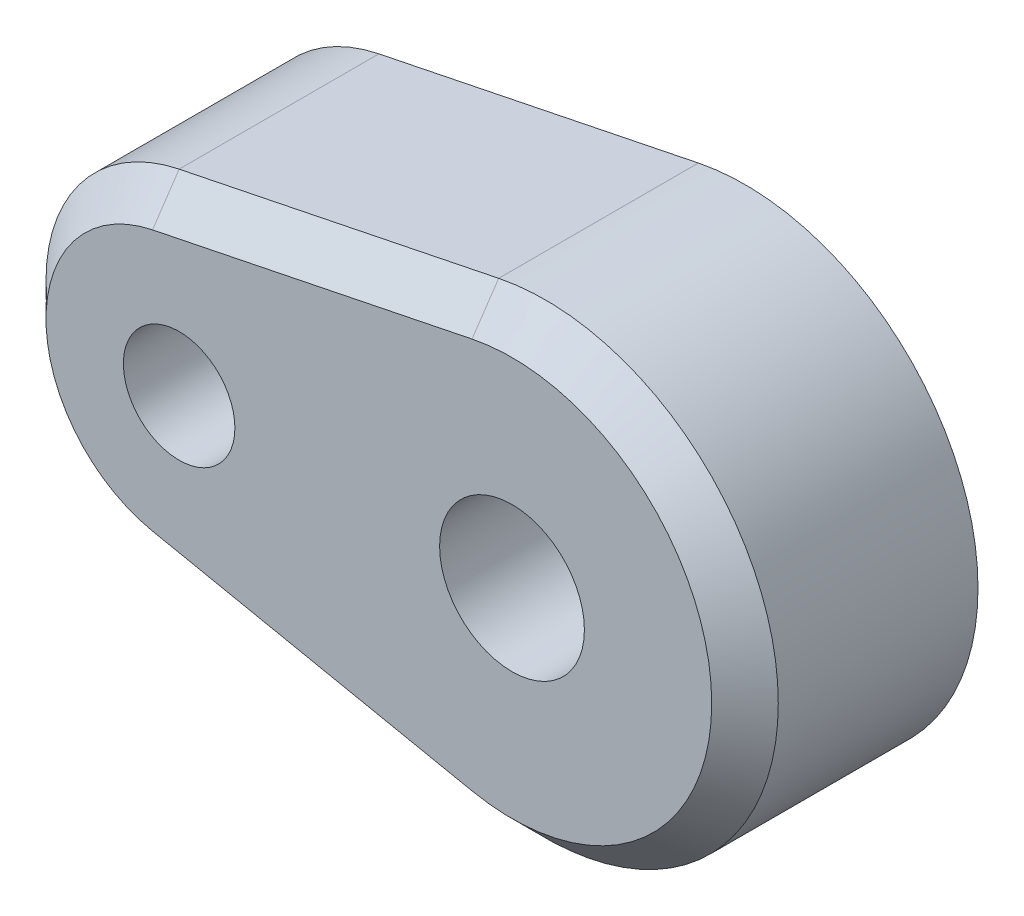
ISO-10303-21;
HEADER;
FILE_DESCRIPTION(('STEP AP214'),'2;1');
FILE_NAME('part.step','',(''),(''),'','','');
FILE_SCHEMA(('AUTOMOTIVE_DESIGN { 1 0 10303 214 1 1 1 1 }'));
ENDSEC;
DATA;
#1=APPLICATION_CONTEXT('core data for automotive mechanical design processes');
#2=APPLICATION_PROTOCOL_DEFINITION('international standard','automotive_design',2000,#1);
#3=PRODUCT_CONTEXT('',#1,'mechanical');
#4=PRODUCT('Part','Part','',(#3));
#5=PRODUCT_RELATED_PRODUCT_CATEGORY('part','',(#4));
#6=PRODUCT_DEFINITION_FORMATION('','',#4);
#7=PRODUCT_DEFINITION_CONTEXT('part definition',#1,'design');
#8=PRODUCT_DEFINITION('design','',#6,#7);
#9=PRODUCT_DEFINITION_SHAPE('','',#8);
#10=(LENGTH_UNIT() NAMED_UNIT(*) SI_UNIT(.MILLI.,.METRE.));
#11=(NAMED_UNIT(*) PLANE_ANGLE_UNIT() SI_UNIT($,.RADIAN.));
#12=(NAMED_UNIT(*) SI_UNIT($,.STERADIAN.) SOLID_ANGLE_UNIT());
#13=UNCERTAINTY_MEASURE_WITH_UNIT(LENGTH_MEASURE(1.E-05),#10,'distance_accuracy_value','');
#14=(GEOMETRIC_REPRESENTATION_CONTEXT(3) GLOBAL_UNCERTAINTY_ASSIGNED_CONTEXT((#13)) GLOBAL_UNIT_ASSIGNED_CONTEXT((#10,
#11,#12)) REPRESENTATION_CONTEXT('',''));
#15=CARTESIAN_POINT('',(0.,0.,0.));
#16=DIRECTION('',(0.,0.,1.));
#17=DIRECTION('',(1.,0.,0.));
#18=AXIS2_PLACEMENT_3D('',#15,#16,#17);
#19=CARTESIAN_POINT('',(0.,0.,7.));
#20=DIRECTION('',(0.,0.,-1.));
#21=DIRECTION('',(-1.,0.,0.));
#22=AXIS2_PLACEMENT_3D('',#19,#20,#21);
#23=CYLINDRICAL_SURFACE('',#22,2.175);
#24=CARTESIAN_POINT('',(0.,0.,7.));
#25=DIRECTION('',(0.,0.,1.));
#26=DIRECTION('',(1.,0.,0.));
#27=AXIS2_PLACEMENT_3D('',#24,#25,#26);
#28=CIRCLE('',#27,2.175);
#29=CARTESIAN_POINT('',(2.175,0.,7.));
#30=VERTEX_POINT('',#29);
#31=EDGE_CURVE('E105',#30,#30,#28,.T.);
#32=ORIENTED_EDGE('',*,*,#31,.T.);
#33=EDGE_LOOP('',(#32));
#34=FACE_BOUND('',#33,.T.);
#35=CARTESIAN_POINT('',(0.,0.,3.4));
#36=DIRECTION('',(0.,0.,-1.));
#37=DIRECTION('',(-1.,0.,0.));
#38=AXIS2_PLACEMENT_3D('',#35,#36,#37);
#39=CIRCLE('',#38,2.175);
#40=CARTESIAN_POINT('',(-2.175,0.,3.4));
#41=VERTEX_POINT('',#40);
#42=EDGE_CURVE('E119',#41,#41,#39,.T.);
#43=ORIENTED_EDGE('',*,*,#42,.T.);
#44=EDGE_LOOP('',(#43));
#45=FACE_BOUND('',#44,.T.);
#46=ADVANCED_FACE('F33',(#34,#45),#23,.F.);
#47=CARTESIAN_POINT('',(0.,0.,7.));
#48=DIRECTION('',(0.,0.,1.));
#49=DIRECTION('',(1.,0.,0.));
#50=AXIS2_PLACEMENT_3D('',#47,#48,#49);
#51=PLANE('',#50);
#52=DIRECTION('',(-0.979795897113271,-0.2,0.));
#53=VECTOR('',#52,1.);
#54=CARTESIAN_POINT('',(-10.8,3.91918358845308,7.));
#55=LINE('',#54,#53);
#56=CARTESIAN_POINT('',(-1.2,5.87877538267962,7.));
#57=VERTEX_POINT('',#56);
#58=CARTESIAN_POINT('',(-10.8,3.91918358845308,7.));
#59=VERTEX_POINT('',#58);
#60=EDGE_CURVE('E124',#57,#59,#55,.T.);
#61=ORIENTED_EDGE('',*,*,#60,.T.);
#62=CARTESIAN_POINT('',(-10.,0.,7.));
#63=DIRECTION('',(0.,0.,1.));
#64=DIRECTION('',(1.,0.,0.));
#65=AXIS2_PLACEMENT_3D('',#62,#63,#64);
#66=CIRCLE('',#65,4.);
#67=CARTESIAN_POINT('',(-10.8,-3.91918358845308,7.));
#68=VERTEX_POINT('',#67);
#69=EDGE_CURVE('E128',#59,#68,#66,.T.);
#70=ORIENTED_EDGE('',*,*,#69,.T.);
#71=DIRECTION('',(0.979795897113271,-0.2,0.));
#72=VECTOR('',#71,1.);
#73=CARTESIAN_POINT('',(-1.2,-5.87877538267962,7.));
#74=LINE('',#73,#72);
#75=CARTESIAN_POINT('',(-1.2,-5.87877538267962,7.));
#76=VERTEX_POINT('',#75);
#77=EDGE_CURVE('E126',#68,#76,#74,.T.);
#78=ORIENTED_EDGE('',*,*,#77,.T.);
#79=CARTESIAN_POINT('',(0.,0.,7.));
#80=DIRECTION('',(0.,0.,1.));
#81=DIRECTION('',(1.,0.,0.));
#82=AXIS2_PLACEMENT_3D('',#79,#80,#81);
#83=CIRCLE('',#82,5.99999999999999);
#84=EDGE_CURVE('E91',#76,#57,#83,.T.);
#85=ORIENTED_EDGE('',*,*,#84,.T.);
#86=EDGE_LOOP('',(#61,#70,#78,#85));
#87=FACE_BOUND('',#86,.T.);
#88=ORIENTED_EDGE('',*,*,#31,.F.);
#89=EDGE_LOOP('',(#88));
#90=FACE_BOUND('',#89,.T.);
#91=CARTESIAN_POINT('',(-10.,0.,7.));
#92=DIRECTION('',(0.,0.,1.));
#93=DIRECTION('',(1.,0.,0.));
#94=AXIS2_PLACEMENT_3D('',#91,#92,#93);
#95=CIRCLE('',#94,1.675);
#96=CARTESIAN_POINT('',(-8.325,0.,7.));
#97=VERTEX_POINT('',#96);
#98=EDGE_CURVE('E108',#97,#97,#95,.T.);
#99=ORIENTED_EDGE('',*,*,#98,.F.);
#100=EDGE_LOOP('',(#99));
#101=FACE_BOUND('',#100,.T.);
#102=ADVANCED_FACE('F167',(#87,#90,#101),#51,.T.);
#103=CARTESIAN_POINT('',(0.,0.,0.));
#104=DIRECTION('',(0.,0.,1.));
#105=DIRECTION('',(1.,0.,0.));
#106=AXIS2_PLACEMENT_3D('',#103,#104,#105);
#107=PLANE('',#106);
#108=CARTESIAN_POINT('',(-10.,0.,0.));
#109=DIRECTION('',(0.,0.,1.));
#110=DIRECTION('',(1.,0.,0.));
#111=AXIS2_PLACEMENT_3D('',#108,#109,#110);
#112=CIRCLE('',#111,2.175);
#113=CARTESIAN_POINT('',(-7.825,0.,0.));
#114=VERTEX_POINT('',#113);
#115=EDGE_CURVE('E151',#114,#114,#112,.T.);
#116=ORIENTED_EDGE('',*,*,#115,.T.);
#117=EDGE_LOOP('',(#116));
#118=FACE_BOUND('',#117,.T.);
#119=CARTESIAN_POINT('',(0.,0.,0.));
#120=DIRECTION('',(0.,0.,1.));
#121=DIRECTION('',(1.,0.,0.));
#122=AXIS2_PLACEMENT_3D('',#119,#120,#121);
#123=CIRCLE('',#122,5.5);
#124=CARTESIAN_POINT('',(5.5,0.,0.));
#125=VERTEX_POINT('',#124);
#126=EDGE_CURVE('E138',#125,#125,#123,.T.);
#127=ORIENTED_EDGE('',*,*,#126,.T.);
#128=EDGE_LOOP('',(#127));
#129=FACE_BOUND('',#128,.T.);
#130=CARTESIAN_POINT('',(0.,0.,0.));
#131=DIRECTION('',(0.,0.,1.));
#132=DIRECTION('',(1.,0.,0.));
#133=AXIS2_PLACEMENT_3D('',#130,#131,#132);
#134=CIRCLE('',#133,7.);
#135=CARTESIAN_POINT('',(-1.4,-6.8585712797929,0.));
#136=VERTEX_POINT('',#135);
#137=CARTESIAN_POINT('',(-1.4,6.8585712797929,0.));
#138=VERTEX_POINT('',#137);
#139=EDGE_CURVE('E98',#136,#138,#134,.T.);
#140=ORIENTED_EDGE('',*,*,#139,.F.);
#141=DIRECTION('',(0.979795897113271,-0.2,0.));
#142=VECTOR('',#141,1.);
#143=CARTESIAN_POINT('',(-11.,-4.89897948556636,0.));
#144=LINE('',#143,#142);
#145=CARTESIAN_POINT('',(-11.,-4.89897948556636,0.));
#146=VERTEX_POINT('',#145);
#147=EDGE_CURVE('E113',#146,#136,#144,.T.);
#148=ORIENTED_EDGE('',*,*,#147,.F.);
#149=CARTESIAN_POINT('',(-10.,0.,0.));
#150=DIRECTION('',(0.,0.,1.));
#151=DIRECTION('',(1.,0.,0.));
#152=AXIS2_PLACEMENT_3D('',#149,#150,#151);
#153=CIRCLE('',#152,5.);
#154=CARTESIAN_POINT('',(-11.,4.89897948556635,0.));
#155=VERTEX_POINT('',#154);
#156=EDGE_CURVE('E100',#155,#146,#153,.T.);
#157=ORIENTED_EDGE('',*,*,#156,.F.);
#158=DIRECTION('',(-0.979795897113271,-0.2,0.));
#159=VECTOR('',#158,1.);
#160=CARTESIAN_POINT('',(-1.4,6.8585712797929,0.));
#161=LINE('',#160,#159);
#162=EDGE_CURVE('E88',#138,#155,#161,.T.);
#163=ORIENTED_EDGE('',*,*,#162,.F.);
#164=EDGE_LOOP('',(#140,#148,#157,#163));
#165=FACE_BOUND('',#164,.T.);
#166=ADVANCED_FACE('F96',(#118,#129,#165),#107,.F.);
#167=CARTESIAN_POINT('',(0.,0.,7.));
#168=DIRECTION('',(0.,0.,-1.));
#169=DIRECTION('',(-1.,0.,0.));
#170=AXIS2_PLACEMENT_3D('',#167,#168,#169);
#171=CYLINDRICAL_SURFACE('',#170,7.);
#172=DIRECTION('',(0.,0.,-1.));
#173=VECTOR('',#172,1.);
#174=CARTESIAN_POINT('',(-1.4,6.8585712797929,7.));
#175=LINE('',#174,#173);
#176=CARTESIAN_POINT('',(-1.4,6.8585712797929,5.99999999999999));
#177=VERTEX_POINT('',#176);
#178=EDGE_CURVE('E85',#177,#138,#175,.T.);
#179=ORIENTED_EDGE('',*,*,#178,.F.);
#180=CARTESIAN_POINT('',(0.,0.,5.99999999999999));
#181=DIRECTION('',(0.,0.,1.));
#182=DIRECTION('',(1.,0.,0.));
#183=AXIS2_PLACEMENT_3D('',#180,#181,#182);
#184=CIRCLE('',#183,7.);
#185=CARTESIAN_POINT('',(-1.4,-6.8585712797929,5.99999999999999));
#186=VERTEX_POINT('',#185);
#187=EDGE_CURVE('E55',#177,#186,#184,.F.);
#188=ORIENTED_EDGE('',*,*,#187,.T.);
#189=DIRECTION('',(0.,0.,-1.));
#190=VECTOR('',#189,1.);
#191=CARTESIAN_POINT('',(-1.4,-6.8585712797929,7.));
#192=LINE('',#191,#190);
#193=EDGE_CURVE('E103',#186,#136,#192,.T.);
#194=ORIENTED_EDGE('',*,*,#193,.T.);
#195=ORIENTED_EDGE('',*,*,#139,.T.);
#196=EDGE_LOOP('',(#179,#188,#194,#195));
#197=FACE_BOUND('',#196,.T.);
#198=ADVANCED_FACE('F102',(#197),#171,.T.);
#199=CARTESIAN_POINT('',(-1.4,6.8585712797929,7.));
#200=DIRECTION('',(0.2,-0.979795897113271,0.));
#201=DIRECTION('',(0.979795897113271,0.2,0.));
#202=AXIS2_PLACEMENT_3D('',#199,#200,#201);
#203=PLANE('',#202);
#204=DIRECTION('',(0.,0.,-1.));
#205=VECTOR('',#204,1.);
#206=CARTESIAN_POINT('',(-11.,4.89897948556635,7.));
#207=LINE('',#206,#205);
#208=CARTESIAN_POINT('',(-11.,4.89897948556635,5.99999999999999));
#209=VERTEX_POINT('',#208);
#210=EDGE_CURVE('E92',#209,#155,#207,.T.);
#211=ORIENTED_EDGE('',*,*,#210,.F.);
#212=DIRECTION('',(0.979795897113271,0.2,0.));
#213=VECTOR('',#212,1.);
#214=CARTESIAN_POINT('',(-1.4,6.8585712797929,5.99999999999999));
#215=LINE('',#214,#213);
#216=EDGE_CURVE('E48',#209,#177,#215,.T.);
#217=ORIENTED_EDGE('',*,*,#216,.T.);
#218=ORIENTED_EDGE('',*,*,#178,.T.);
#219=ORIENTED_EDGE('',*,*,#162,.T.);
#220=EDGE_LOOP('',(#211,#217,#218,#219));
#221=FACE_BOUND('',#220,.T.);
#222=ADVANCED_FACE('F87',(#221),#203,.F.);
#223=CARTESIAN_POINT('',(-10.,0.,7.));
#224=DIRECTION('',(0.,0.,-1.));
#225=DIRECTION('',(-1.,0.,0.));
#226=AXIS2_PLACEMENT_3D('',#223,#224,#225);
#227=CYLINDRICAL_SURFACE('',#226,5.);
#228=DIRECTION('',(0.,0.,-1.));
#229=VECTOR('',#228,1.);
#230=CARTESIAN_POINT('',(-11.,-4.89897948556636,7.));
#231=LINE('',#230,#229);
#232=CARTESIAN_POINT('',(-11.,-4.89897948556636,5.99999999999999));
#233=VERTEX_POINT('',#232);
#234=EDGE_CURVE('E116',#233,#146,#231,.T.);
#235=ORIENTED_EDGE('',*,*,#234,.F.);
#236=CARTESIAN_POINT('',(-10.,0.,5.99999999999999));
#237=DIRECTION('',(0.,0.,1.));
#238=DIRECTION('',(1.,0.,0.));
#239=AXIS2_PLACEMENT_3D('',#236,#237,#238);
#240=CIRCLE('',#239,5.);
#241=EDGE_CURVE('E131',#233,#209,#240,.F.);
#242=ORIENTED_EDGE('',*,*,#241,.T.);
#243=ORIENTED_EDGE('',*,*,#210,.T.);
#244=ORIENTED_EDGE('',*,*,#156,.T.);
#245=EDGE_LOOP('',(#235,#242,#243,#244));
#246=FACE_BOUND('',#245,.T.);
#247=ADVANCED_FACE('F201',(#246),#227,.T.);
#248=CARTESIAN_POINT('',(-11.,-4.89897948556636,7.));
#249=DIRECTION('',(0.2,0.979795897113271,0.));
#250=DIRECTION('',(-0.979795897113271,0.2,0.));
#251=AXIS2_PLACEMENT_3D('',#248,#249,#250);
#252=PLANE('',#251);
#253=ORIENTED_EDGE('',*,*,#193,.F.);
#254=DIRECTION('',(-0.979795897113271,0.2,0.));
#255=VECTOR('',#254,1.);
#256=CARTESIAN_POINT('',(-11.,-4.89897948556636,5.99999999999999));
#257=LINE('',#256,#255);
#258=EDGE_CURVE('E134',#186,#233,#257,.T.);
#259=ORIENTED_EDGE('',*,*,#258,.T.);
#260=ORIENTED_EDGE('',*,*,#234,.T.);
#261=ORIENTED_EDGE('',*,*,#147,.T.);
#262=EDGE_LOOP('',(#253,#259,#260,#261));
#263=FACE_BOUND('',#262,.T.);
#264=ADVANCED_FACE('F198',(#263),#252,.F.);
#265=CARTESIAN_POINT('',(-10.,0.,7.));
#266=DIRECTION('',(0.,0.,-1.));
#267=DIRECTION('',(-1.,0.,0.));
#268=AXIS2_PLACEMENT_3D('',#265,#266,#267);
#269=CYLINDRICAL_SURFACE('',#268,1.675);
#270=CARTESIAN_POINT('',(-10.,0.,0.5));
#271=DIRECTION('',(0.,0.,1.));
#272=DIRECTION('',(1.,0.,0.));
#273=AXIS2_PLACEMENT_3D('',#270,#271,#272);
#274=CIRCLE('',#273,1.675);
#275=CARTESIAN_POINT('',(-8.325,0.,0.5));
#276=VERTEX_POINT('',#275);
#277=EDGE_CURVE('E41',#276,#276,#274,.F.);
#278=ORIENTED_EDGE('',*,*,#277,.T.);
#279=EDGE_LOOP('',(#278));
#280=FACE_BOUND('',#279,.T.);
#281=ORIENTED_EDGE('',*,*,#98,.T.);
#282=EDGE_LOOP('',(#281));
#283=FACE_BOUND('',#282,.T.);
#284=ADVANCED_FACE('F156',(#280,#283),#269,.F.);
#285=CARTESIAN_POINT('',(0.,0.,3.4));
#286=DIRECTION('',(0.,0.,-1.));
#287=DIRECTION('',(-1.,0.,0.));
#288=AXIS2_PLACEMENT_3D('',#285,#286,#287);
#289=CYLINDRICAL_SURFACE('',#288,5.);
#290=CARTESIAN_POINT('',(0.,0.,0.5));
#291=DIRECTION('',(0.,0.,1.));
#292=DIRECTION('',(1.,0.,0.));
#293=AXIS2_PLACEMENT_3D('',#290,#291,#292);
#294=CIRCLE('',#293,5.);
#295=CARTESIAN_POINT('',(5.,0.,0.5));
#296=VERTEX_POINT('',#295);
#297=EDGE_CURVE('E11',#296,#296,#294,.F.);
#298=ORIENTED_EDGE('',*,*,#297,.T.);
#299=EDGE_LOOP('',(#298));
#300=FACE_BOUND('',#299,.T.);
#301=CARTESIAN_POINT('',(0.,0.,3.4));
#302=DIRECTION('',(0.,0.,-1.));
#303=DIRECTION('',(-1.,0.,0.));
#304=AXIS2_PLACEMENT_3D('',#301,#302,#303);
#305=CIRCLE('',#304,5.);
#306=CARTESIAN_POINT('',(-5.,0.,3.4));
#307=VERTEX_POINT('',#306);
#308=EDGE_CURVE('E122',#307,#307,#305,.T.);
#309=ORIENTED_EDGE('',*,*,#308,.F.);
#310=EDGE_LOOP('',(#309));
#311=FACE_BOUND('',#310,.T.);
#312=ADVANCED_FACE('F175',(#300,#311),#289,.F.);
#313=CARTESIAN_POINT('',(0.,0.,3.4));
#314=DIRECTION('',(0.,0.,-1.));
#315=DIRECTION('',(-1.,0.,0.));
#316=AXIS2_PLACEMENT_3D('',#313,#314,#315);
#317=PLANE('',#316);
#318=ORIENTED_EDGE('',*,*,#42,.F.);
#319=EDGE_LOOP('',(#318));
#320=FACE_BOUND('',#319,.T.);
#321=ORIENTED_EDGE('',*,*,#308,.T.);
#322=EDGE_LOOP('',(#321));
#323=FACE_BOUND('',#322,.T.);
#324=ADVANCED_FACE('F178',(#320,#323),#317,.T.);
#325=CARTESIAN_POINT('',(0.,0.,7.));
#326=DIRECTION('',(0.,0.,-1.));
#327=DIRECTION('',(-1.,0.,0.));
#328=AXIS2_PLACEMENT_3D('',#325,#326,#327);
#329=CONICAL_SURFACE('',#328,5.99999999999999,0.785398163397447);
#330=DIRECTION('',(0.141421356237309,0.69282032302755,0.707106781186549));
#331=VECTOR('',#330,1.);
#332=CARTESIAN_POINT('',(-1.4,-6.8585712797929,5.99999999999999));
#333=LINE('',#332,#331);
#334=EDGE_CURVE('E143',#186,#76,#333,.T.);
#335=ORIENTED_EDGE('',*,*,#334,.F.);
#336=ORIENTED_EDGE('',*,*,#187,.F.);
#337=DIRECTION('',(-0.141421356237309,0.69282032302755,-0.707106781186549));
#338=VECTOR('',#337,1.);
#339=CARTESIAN_POINT('',(-1.2,5.87877538267962,7.));
#340=LINE('',#339,#338);
#341=EDGE_CURVE('E146',#57,#177,#340,.T.);
#342=ORIENTED_EDGE('',*,*,#341,.F.);
#343=ORIENTED_EDGE('',*,*,#84,.F.);
#344=EDGE_LOOP('',(#335,#336,#342,#343));
#345=FACE_BOUND('',#344,.T.);
#346=ADVANCED_FACE('F220',(#345),#329,.T.);
#347=CARTESIAN_POINT('',(-1.2,5.87877538267962,7.));
#348=DIRECTION('',(-0.14142135623731,0.692820323027552,0.707106781186546));
#349=DIRECTION('',(0.979795897113271,0.2,0.));
#350=AXIS2_PLACEMENT_3D('',#347,#348,#349);
#351=PLANE('',#350);
#352=ORIENTED_EDGE('',*,*,#341,.T.);
#353=ORIENTED_EDGE('',*,*,#216,.F.);
#354=DIRECTION('',(-0.141421356237309,0.69282032302755,-0.707106781186549));
#355=VECTOR('',#354,1.);
#356=CARTESIAN_POINT('',(-10.8,3.91918358845308,7.));
#357=LINE('',#356,#355);
#358=EDGE_CURVE('E141',#59,#209,#357,.T.);
#359=ORIENTED_EDGE('',*,*,#358,.F.);
#360=ORIENTED_EDGE('',*,*,#60,.F.);
#361=EDGE_LOOP('',(#352,#353,#359,#360));
#362=FACE_BOUND('',#361,.T.);
#363=ADVANCED_FACE('F216',(#362),#351,.T.);
#364=CARTESIAN_POINT('',(-1.2,-5.87877538267962,7.));
#365=DIRECTION('',(-0.141421356237309,-0.692820323027552,0.707106781186546));
#366=DIRECTION('',(-0.979795897113271,0.2,0.));
#367=AXIS2_PLACEMENT_3D('',#364,#365,#366);
#368=PLANE('',#367);
#369=ORIENTED_EDGE('',*,*,#334,.T.);
#370=ORIENTED_EDGE('',*,*,#77,.F.);
#371=DIRECTION('',(0.141421356237309,0.69282032302755,0.707106781186549));
#372=VECTOR('',#371,1.);
#373=CARTESIAN_POINT('',(-11.,-4.89897948556636,5.99999999999999));
#374=LINE('',#373,#372);
#375=EDGE_CURVE('E139',#233,#68,#374,.T.);
#376=ORIENTED_EDGE('',*,*,#375,.F.);
#377=ORIENTED_EDGE('',*,*,#258,.F.);
#378=EDGE_LOOP('',(#369,#370,#376,#377));
#379=FACE_BOUND('',#378,.T.);
#380=ADVANCED_FACE('F212',(#379),#368,.T.);
#381=CARTESIAN_POINT('',(-10.,0.,7.));
#382=DIRECTION('',(0.,0.,-1.));
#383=DIRECTION('',(-1.,0.,0.));
#384=AXIS2_PLACEMENT_3D('',#381,#382,#383);
#385=CONICAL_SURFACE('',#384,4.,0.785398163397447);
#386=ORIENTED_EDGE('',*,*,#358,.T.);
#387=ORIENTED_EDGE('',*,*,#241,.F.);
#388=ORIENTED_EDGE('',*,*,#375,.T.);
#389=ORIENTED_EDGE('',*,*,#69,.F.);
#390=EDGE_LOOP('',(#386,#387,#388,#389));
#391=FACE_BOUND('',#390,.T.);
#392=ADVANCED_FACE('F162',(#391),#385,.T.);
#393=CARTESIAN_POINT('',(-10.,0.,0.5));
#394=DIRECTION('',(0.,0.,1.));
#395=DIRECTION('',(1.,0.,0.));
#396=AXIS2_PLACEMENT_3D('',#393,#394,#395);
#397=TOROIDAL_SURFACE('',#396,2.175,0.5);
#398=ORIENTED_EDGE('',*,*,#277,.F.);
#399=EDGE_LOOP('',(#398));
#400=FACE_BOUND('',#399,.T.);
#401=ORIENTED_EDGE('',*,*,#115,.F.);
#402=EDGE_LOOP('',(#401));
#403=FACE_BOUND('',#402,.T.);
#404=ADVANCED_FACE('F159',(#400,#403),#397,.T.);
#405=CARTESIAN_POINT('',(0.,0.,0.5));
#406=DIRECTION('',(0.,0.,1.));
#407=DIRECTION('',(1.,0.,0.));
#408=AXIS2_PLACEMENT_3D('',#405,#406,#407);
#409=TOROIDAL_SURFACE('',#408,5.5,0.5);
#410=ORIENTED_EDGE('',*,*,#126,.F.);
#411=EDGE_LOOP('',(#410));
#412=FACE_BOUND('',#411,.T.);
#413=ORIENTED_EDGE('',*,*,#297,.F.);
#414=EDGE_LOOP('',(#413));
#415=FACE_BOUND('',#414,.T.);
#416=ADVANCED_FACE('F35',(#412,#415),#409,.T.);
#417=CLOSED_SHELL('',(#46,#102,#166,#198,#222,#247,#264,#284,#312,#324,#346,#363,#380,#392,#404,#416));
#418=MANIFOLD_SOLID_BREP('B2',#417);
#419=ADVANCED_BREP_SHAPE_REPRESENTATION('',(#18,#418),#14);
#420=SHAPE_DEFINITION_REPRESENTATION(#9,#419);
ENDSEC;
END-ISO-10303-21;
